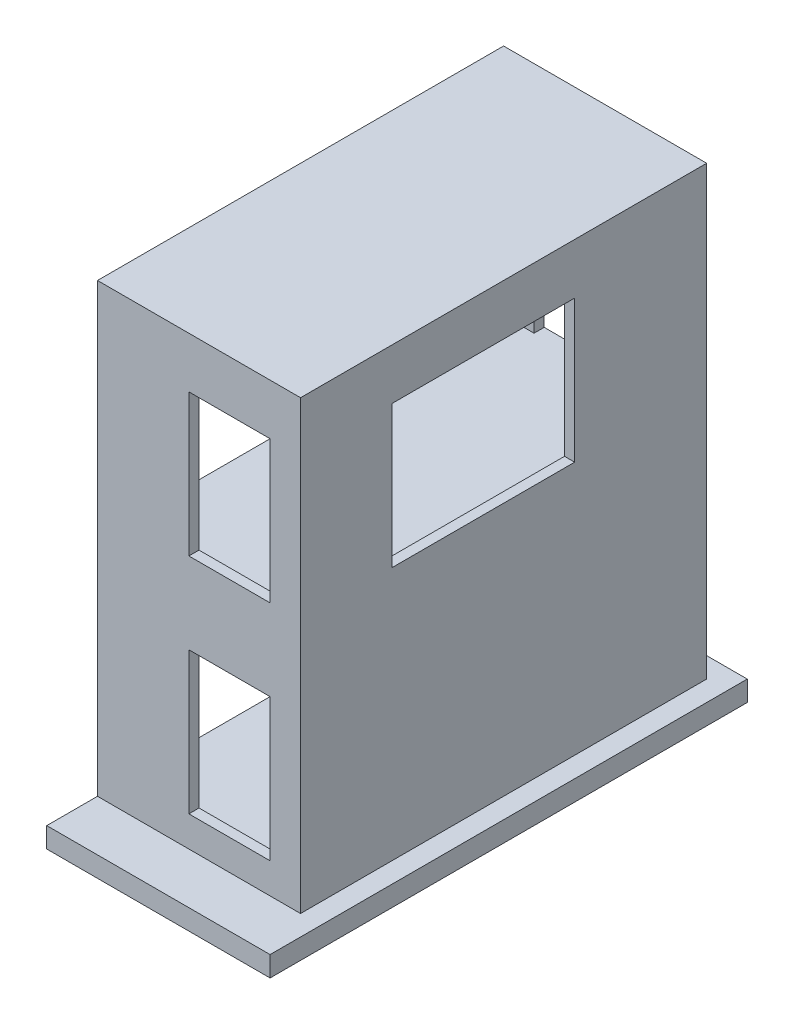
ISO-10303-21;
HEADER;
FILE_DESCRIPTION(('STEP AP214'),'2;1');
FILE_NAME('part.step','',(''),(''),'','','');
FILE_SCHEMA(('AUTOMOTIVE_DESIGN { 1 0 10303 214 1 1 1 1 }'));
ENDSEC;
DATA;
#1=APPLICATION_CONTEXT('core data for automotive mechanical design processes');
#2=APPLICATION_PROTOCOL_DEFINITION('international standard','automotive_design',2000,#1);
#3=PRODUCT_CONTEXT('',#1,'mechanical');
#4=PRODUCT('Part','Part','',(#3));
#5=PRODUCT_RELATED_PRODUCT_CATEGORY('part','',(#4));
#6=PRODUCT_DEFINITION_FORMATION('','',#4);
#7=PRODUCT_DEFINITION_CONTEXT('part definition',#1,'design');
#8=PRODUCT_DEFINITION('design','',#6,#7);
#9=PRODUCT_DEFINITION_SHAPE('','',#8);
#10=(LENGTH_UNIT() NAMED_UNIT(*) SI_UNIT(.MILLI.,.METRE.));
#11=(NAMED_UNIT(*) PLANE_ANGLE_UNIT() SI_UNIT($,.RADIAN.));
#12=(NAMED_UNIT(*) SI_UNIT($,.STERADIAN.) SOLID_ANGLE_UNIT());
#13=UNCERTAINTY_MEASURE_WITH_UNIT(LENGTH_MEASURE(1.E-05),#10,'distance_accuracy_value','');
#14=(GEOMETRIC_REPRESENTATION_CONTEXT(3) GLOBAL_UNCERTAINTY_ASSIGNED_CONTEXT((#13)) GLOBAL_UNIT_ASSIGNED_CONTEXT((#10,
#11,#12)) REPRESENTATION_CONTEXT('',''));
#15=CARTESIAN_POINT('',(0.,0.,0.));
#16=DIRECTION('',(0.,0.,1.));
#17=DIRECTION('',(1.,0.,0.));
#18=AXIS2_PLACEMENT_3D('',#15,#16,#17);
#19=CARTESIAN_POINT('',(0.,220.,0.));
#20=DIRECTION('',(0.,-1.,0.));
#21=DIRECTION('',(0.,0.,-1.));
#22=AXIS2_PLACEMENT_3D('',#19,#20,#21);
#23=PLANE('',#22);
#24=DIRECTION('',(0.,0.,1.));
#25=VECTOR('',#24,1.);
#26=CARTESIAN_POINT('',(45.,220.,-42.4999999999999));
#27=LINE('',#26,#25);
#28=CARTESIAN_POINT('',(44.9999999999999,220.,-102.5));
#29=VERTEX_POINT('',#28);
#30=CARTESIAN_POINT('',(45.,220.,87.5000000000002));
#31=VERTEX_POINT('',#30);
#32=EDGE_CURVE('E431',#29,#31,#27,.T.);
#33=ORIENTED_EDGE('',*,*,#32,.T.);
#34=DIRECTION('',(-1.,0.,0.));
#35=VECTOR('',#34,1.);
#36=CARTESIAN_POINT('',(45.,220.,87.5000000000002));
#37=LINE('',#36,#35);
#38=CARTESIAN_POINT('',(-50.,220.,87.5000000000002));
#39=VERTEX_POINT('',#38);
#40=EDGE_CURVE('E446',#31,#39,#37,.T.);
#41=ORIENTED_EDGE('',*,*,#40,.T.);
#42=DIRECTION('',(0.,0.,1.));
#43=VECTOR('',#42,1.);
#44=CARTESIAN_POINT('',(-50.,220.,92.5000000000002));
#45=LINE('',#44,#43);
#46=CARTESIAN_POINT('',(-50.,220.,-102.5));
#47=VERTEX_POINT('',#46);
#48=EDGE_CURVE('E479',#47,#39,#45,.T.);
#49=ORIENTED_EDGE('',*,*,#48,.F.);
#50=DIRECTION('',(1.,0.,0.));
#51=VECTOR('',#50,1.);
#52=CARTESIAN_POINT('',(44.9999999999999,220.,-102.5));
#53=LINE('',#52,#51);
#54=EDGE_CURVE('E435',#47,#29,#53,.T.);
#55=ORIENTED_EDGE('',*,*,#54,.T.);
#56=EDGE_LOOP('',(#33,#41,#49,#55));
#57=FACE_BOUND('',#56,.T.);
#58=ADVANCED_FACE('F45',(#57),#23,.T.);
#59=CARTESIAN_POINT('',(0.,110.,0.));
#60=DIRECTION('',(0.,-1.,0.));
#61=DIRECTION('',(0.,0.,-1.));
#62=AXIS2_PLACEMENT_3D('',#59,#60,#61);
#63=PLANE('',#62);
#64=DIRECTION('',(-1.,0.,0.));
#65=VECTOR('',#64,1.);
#66=CARTESIAN_POINT('',(34.9999999999999,110.,87.5000000000002));
#67=LINE('',#66,#65);
#68=CARTESIAN_POINT('',(44.9999999999999,110.,87.5000000000002));
#69=VERTEX_POINT('',#68);
#70=CARTESIAN_POINT('',(-50.,110.,87.5000000000002));
#71=VERTEX_POINT('',#70);
#72=EDGE_CURVE('E358',#69,#71,#67,.T.);
#73=ORIENTED_EDGE('',*,*,#72,.T.);
#74=DIRECTION('',(0.,0.,1.));
#75=VECTOR('',#74,1.);
#76=CARTESIAN_POINT('',(-50.,110.,92.5000000000001));
#77=LINE('',#76,#75);
#78=CARTESIAN_POINT('',(-50.,110.,-102.5));
#79=VERTEX_POINT('',#78);
#80=EDGE_CURVE('E410',#79,#71,#77,.T.);
#81=ORIENTED_EDGE('',*,*,#80,.F.);
#82=DIRECTION('',(1.,0.,0.));
#83=VECTOR('',#82,1.);
#84=CARTESIAN_POINT('',(44.9999999999999,110.,-102.5));
#85=LINE('',#84,#83);
#86=CARTESIAN_POINT('',(44.9999999999999,110.,-102.5));
#87=VERTEX_POINT('',#86);
#88=EDGE_CURVE('E363',#79,#87,#85,.T.);
#89=ORIENTED_EDGE('',*,*,#88,.T.);
#90=DIRECTION('',(0.,0.,1.));
#91=VECTOR('',#90,1.);
#92=CARTESIAN_POINT('',(44.9999999999999,110.,87.5000000000002));
#93=LINE('',#92,#91);
#94=EDGE_CURVE('E388',#87,#69,#93,.T.);
#95=ORIENTED_EDGE('',*,*,#94,.T.);
#96=EDGE_LOOP('',(#73,#81,#89,#95));
#97=FACE_BOUND('',#96,.T.);
#98=ADVANCED_FACE('F684',(#97),#63,.T.);
#99=CARTESIAN_POINT('',(0.,10.,0.));
#100=DIRECTION('',(0.,-1.,0.));
#101=DIRECTION('',(0.,0.,-1.));
#102=AXIS2_PLACEMENT_3D('',#99,#100,#101);
#103=PLANE('',#102);
#104=DIRECTION('',(-1.,0.,0.));
#105=VECTOR('',#104,1.);
#106=CARTESIAN_POINT('',(-60.,10.,-117.5));
#107=LINE('',#106,#105);
#108=CARTESIAN_POINT('',(60.,10.,-117.5));
#109=VERTEX_POINT('',#108);
#110=CARTESIAN_POINT('',(-50.,10.,-117.5));
#111=VERTEX_POINT('',#110);
#112=EDGE_CURVE('E312',#109,#111,#107,.T.);
#113=ORIENTED_EDGE('',*,*,#112,.T.);
#114=DIRECTION('',(0.,0.,-1.));
#115=VECTOR('',#114,1.);
#116=CARTESIAN_POINT('',(-50.,10.,-117.5));
#117=LINE('',#116,#115);
#118=CARTESIAN_POINT('',(-50.,10.,-107.5));
#119=VERTEX_POINT('',#118);
#120=EDGE_CURVE('E666',#119,#111,#117,.T.);
#121=ORIENTED_EDGE('',*,*,#120,.F.);
#122=DIRECTION('',(-1.,0.,0.));
#123=VECTOR('',#122,1.);
#124=CARTESIAN_POINT('',(-50.,10.,-107.5));
#125=LINE('',#124,#123);
#126=CARTESIAN_POINT('',(-30.,10.,-107.5));
#127=VERTEX_POINT('',#126);
#128=EDGE_CURVE('E385',#127,#119,#125,.T.);
#129=ORIENTED_EDGE('',*,*,#128,.F.);
#130=DIRECTION('',(0.,0.,-1.));
#131=VECTOR('',#130,1.);
#132=CARTESIAN_POINT('',(-30.,10.,-102.5));
#133=LINE('',#132,#131);
#134=CARTESIAN_POINT('',(-30.,10.,-102.5));
#135=VERTEX_POINT('',#134);
#136=EDGE_CURVE('E587',#135,#127,#133,.T.);
#137=ORIENTED_EDGE('',*,*,#136,.F.);
#138=DIRECTION('',(1.,0.,0.));
#139=VECTOR('',#138,1.);
#140=CARTESIAN_POINT('',(44.9999999999999,10.,-102.5));
#141=LINE('',#140,#139);
#142=CARTESIAN_POINT('',(-50.,10.,-102.5));
#143=VERTEX_POINT('',#142);
#144=EDGE_CURVE('E376',#143,#135,#141,.T.);
#145=ORIENTED_EDGE('',*,*,#144,.F.);
#146=CARTESIAN_POINT('',(-50.,10.,87.5000000000001));
#147=VERTEX_POINT('',#146);
#148=EDGE_CURVE('E665',#147,#143,#117,.T.);
#149=ORIENTED_EDGE('',*,*,#148,.F.);
#150=DIRECTION('',(-1.,0.,0.));
#151=VECTOR('',#150,1.);
#152=CARTESIAN_POINT('',(34.9999999999999,10.,87.5000000000002));
#153=LINE('',#152,#151);
#154=CARTESIAN_POINT('',(44.9999999999999,10.,87.5000000000002));
#155=VERTEX_POINT('',#154);
#156=EDGE_CURVE('E368',#155,#147,#153,.T.);
#157=ORIENTED_EDGE('',*,*,#156,.F.);
#158=DIRECTION('',(0.,0.,1.));
#159=VECTOR('',#158,1.);
#160=CARTESIAN_POINT('',(44.9999999999999,10.,87.5000000000002));
#161=LINE('',#160,#159);
#162=CARTESIAN_POINT('',(44.9999999999999,10.,-102.5));
#163=VERTEX_POINT('',#162);
#164=EDGE_CURVE('E372',#163,#155,#161,.T.);
#165=ORIENTED_EDGE('',*,*,#164,.F.);
#166=CARTESIAN_POINT('',(30.,9.99999999999999,-102.5));
#167=VERTEX_POINT('',#166);
#168=EDGE_CURVE('E380',#167,#163,#141,.T.);
#169=ORIENTED_EDGE('',*,*,#168,.F.);
#170=DIRECTION('',(0.,0.,-1.));
#171=VECTOR('',#170,1.);
#172=CARTESIAN_POINT('',(30.,9.99999999999999,-102.5));
#173=LINE('',#172,#171);
#174=CARTESIAN_POINT('',(30.,9.99999999999999,-107.5));
#175=VERTEX_POINT('',#174);
#176=EDGE_CURVE('E636',#167,#175,#173,.T.);
#177=ORIENTED_EDGE('',*,*,#176,.T.);
#178=CARTESIAN_POINT('',(49.9999999999998,10.,-107.5));
#179=VERTEX_POINT('',#178);
#180=EDGE_CURVE('E381',#179,#175,#125,.T.);
#181=ORIENTED_EDGE('',*,*,#180,.F.);
#182=DIRECTION('',(0.,0.,-1.));
#183=VECTOR('',#182,1.);
#184=CARTESIAN_POINT('',(49.9999999999998,10.,-107.5));
#185=LINE('',#184,#183);
#186=CARTESIAN_POINT('',(49.9999999999998,10.,92.5000000000001));
#187=VERTEX_POINT('',#186);
#188=EDGE_CURVE('E359',#187,#179,#185,.T.);
#189=ORIENTED_EDGE('',*,*,#188,.F.);
#190=DIRECTION('',(1.,0.,0.));
#191=VECTOR('',#190,1.);
#192=CARTESIAN_POINT('',(49.9999999999998,10.,92.5000000000001));
#193=LINE('',#192,#191);
#194=CARTESIAN_POINT('',(-50.0000000000003,10.,92.5000000000005));
#195=VERTEX_POINT('',#194);
#196=EDGE_CURVE('E364',#195,#187,#193,.T.);
#197=ORIENTED_EDGE('',*,*,#196,.F.);
#198=CARTESIAN_POINT('',(-50.,10.,117.5));
#199=VERTEX_POINT('',#198);
#200=EDGE_CURVE('E290',#199,#195,#117,.T.);
#201=ORIENTED_EDGE('',*,*,#200,.F.);
#202=DIRECTION('',(1.,0.,0.));
#203=VECTOR('',#202,1.);
#204=CARTESIAN_POINT('',(-60.,10.,117.5));
#205=LINE('',#204,#203);
#206=CARTESIAN_POINT('',(60.,10.,117.5));
#207=VERTEX_POINT('',#206);
#208=EDGE_CURVE('E298',#199,#207,#205,.T.);
#209=ORIENTED_EDGE('',*,*,#208,.T.);
#210=DIRECTION('',(0.,0.,-1.));
#211=VECTOR('',#210,1.);
#212=CARTESIAN_POINT('',(60.,10.,117.5));
#213=LINE('',#212,#211);
#214=EDGE_CURVE('E306',#207,#109,#213,.T.);
#215=ORIENTED_EDGE('',*,*,#214,.T.);
#216=EDGE_LOOP('',(#113,#121,#129,#137,#145,#149,#157,#165,#169,#177,#181,#189,#197,#201,#209,#215));
#217=FACE_BOUND('',#216,.T.);
#218=ADVANCED_FACE('F674',(#217),#103,.F.);
#219=CARTESIAN_POINT('',(0.,120.,0.));
#220=DIRECTION('',(0.,-1.,0.));
#221=DIRECTION('',(0.,0.,-1.));
#222=AXIS2_PLACEMENT_3D('',#219,#220,#221);
#223=PLANE('',#222);
#224=DIRECTION('',(-1.,0.,0.));
#225=VECTOR('',#224,1.);
#226=CARTESIAN_POINT('',(45.,120.,87.5000000000002));
#227=LINE('',#226,#225);
#228=CARTESIAN_POINT('',(45.,120.,87.5000000000002));
#229=VERTEX_POINT('',#228);
#230=CARTESIAN_POINT('',(-50.,120.,87.5000000000002));
#231=VERTEX_POINT('',#230);
#232=EDGE_CURVE('E449',#229,#231,#227,.T.);
#233=ORIENTED_EDGE('',*,*,#232,.F.);
#234=DIRECTION('',(0.,0.,1.));
#235=VECTOR('',#234,1.);
#236=CARTESIAN_POINT('',(45.,120.,-42.4999999999999));
#237=LINE('',#236,#235);
#238=CARTESIAN_POINT('',(44.9999999999999,120.,-102.5));
#239=VERTEX_POINT('',#238);
#240=EDGE_CURVE('E432',#239,#229,#237,.T.);
#241=ORIENTED_EDGE('',*,*,#240,.F.);
#242=DIRECTION('',(1.,0.,0.));
#243=VECTOR('',#242,1.);
#244=CARTESIAN_POINT('',(44.9999999999999,120.,-102.5));
#245=LINE('',#244,#243);
#246=CARTESIAN_POINT('',(30.,120.,-102.5));
#247=VERTEX_POINT('',#246);
#248=EDGE_CURVE('E440',#247,#239,#245,.T.);
#249=ORIENTED_EDGE('',*,*,#248,.F.);
#250=DIRECTION('',(0.,0.,-1.));
#251=VECTOR('',#250,1.);
#252=CARTESIAN_POINT('',(30.,120.,-102.5));
#253=LINE('',#252,#251);
#254=CARTESIAN_POINT('',(30.,120.,-107.5));
#255=VERTEX_POINT('',#254);
#256=EDGE_CURVE('E621',#247,#255,#253,.T.);
#257=ORIENTED_EDGE('',*,*,#256,.T.);
#258=DIRECTION('',(-1.,0.,0.));
#259=VECTOR('',#258,1.);
#260=CARTESIAN_POINT('',(30.,120.,-107.5));
#261=LINE('',#260,#259);
#262=CARTESIAN_POINT('',(-30.,120.,-107.5));
#263=VERTEX_POINT('',#262);
#264=EDGE_CURVE('E595',#255,#263,#261,.T.);
#265=ORIENTED_EDGE('',*,*,#264,.T.);
#266=DIRECTION('',(0.,0.,-1.));
#267=VECTOR('',#266,1.);
#268=CARTESIAN_POINT('',(-30.,120.,-102.5));
#269=LINE('',#268,#267);
#270=CARTESIAN_POINT('',(-30.,120.,-102.5));
#271=VERTEX_POINT('',#270);
#272=EDGE_CURVE('E618',#271,#263,#269,.T.);
#273=ORIENTED_EDGE('',*,*,#272,.F.);
#274=CARTESIAN_POINT('',(-50.,120.,-102.5));
#275=VERTEX_POINT('',#274);
#276=EDGE_CURVE('E436',#275,#271,#245,.T.);
#277=ORIENTED_EDGE('',*,*,#276,.F.);
#278=DIRECTION('',(0.,0.,1.));
#279=VECTOR('',#278,1.);
#280=CARTESIAN_POINT('',(-50.,120.,92.5000000000001));
#281=LINE('',#280,#279);
#282=EDGE_CURVE('E409',#275,#231,#281,.T.);
#283=ORIENTED_EDGE('',*,*,#282,.T.);
#284=EDGE_LOOP('',(#233,#241,#249,#257,#265,#273,#277,#283));
#285=FACE_BOUND('',#284,.T.);
#286=ADVANCED_FACE('F676',(#285),#223,.F.);
#287=CARTESIAN_POINT('',(60.,10.,117.5));
#288=DIRECTION('',(-1.,0.,0.));
#289=DIRECTION('',(0.,0.,1.));
#290=AXIS2_PLACEMENT_3D('',#287,#288,#289);
#291=PLANE('',#290);
#292=DIRECTION('',(0.,0.,-1.));
#293=VECTOR('',#292,1.);
#294=CARTESIAN_POINT('',(60.,0.,117.5));
#295=LINE('',#294,#293);
#296=CARTESIAN_POINT('',(60.,0.,117.5));
#297=VERTEX_POINT('',#296);
#298=CARTESIAN_POINT('',(60.,0.,-117.5));
#299=VERTEX_POINT('',#298);
#300=EDGE_CURVE('E304',#297,#299,#295,.T.);
#301=ORIENTED_EDGE('',*,*,#300,.T.);
#302=DIRECTION('',(0.,-1.,0.));
#303=VECTOR('',#302,1.);
#304=CARTESIAN_POINT('',(60.,10.,-117.5));
#305=LINE('',#304,#303);
#306=EDGE_CURVE('E11',#109,#299,#305,.T.);
#307=ORIENTED_EDGE('',*,*,#306,.F.);
#308=ORIENTED_EDGE('',*,*,#214,.F.);
#309=DIRECTION('',(0.,-1.,0.));
#310=VECTOR('',#309,1.);
#311=CARTESIAN_POINT('',(60.,10.,117.5));
#312=LINE('',#311,#310);
#313=EDGE_CURVE('E54',#207,#297,#312,.T.);
#314=ORIENTED_EDGE('',*,*,#313,.T.);
#315=EDGE_LOOP('',(#301,#307,#308,#314));
#316=FACE_BOUND('',#315,.T.);
#317=ADVANCED_FACE('F47',(#316),#291,.F.);
#318=CARTESIAN_POINT('',(-60.,10.,-117.5));
#319=DIRECTION('',(0.,0.,1.));
#320=DIRECTION('',(1.,0.,0.));
#321=AXIS2_PLACEMENT_3D('',#318,#319,#320);
#322=PLANE('',#321);
#323=DIRECTION('',(-1.,0.,0.));
#324=VECTOR('',#323,1.);
#325=CARTESIAN_POINT('',(-60.,0.,-117.5));
#326=LINE('',#325,#324);
#327=CARTESIAN_POINT('',(-50.,0.,-117.5));
#328=VERTEX_POINT('',#327);
#329=EDGE_CURVE('E307',#299,#328,#326,.T.);
#330=ORIENTED_EDGE('',*,*,#329,.T.);
#331=DIRECTION('',(0.,1.,0.));
#332=VECTOR('',#331,1.);
#333=CARTESIAN_POINT('',(-50.,0.,-117.5));
#334=LINE('',#333,#332);
#335=EDGE_CURVE('E285',#328,#111,#334,.T.);
#336=ORIENTED_EDGE('',*,*,#335,.T.);
#337=ORIENTED_EDGE('',*,*,#112,.F.);
#338=ORIENTED_EDGE('',*,*,#306,.T.);
#339=EDGE_LOOP('',(#330,#336,#337,#338));
#340=FACE_BOUND('',#339,.T.);
#341=ADVANCED_FACE('F673',(#340),#322,.F.);
#342=CARTESIAN_POINT('',(-60.,10.,117.5));
#343=DIRECTION('',(0.,0.,-1.));
#344=DIRECTION('',(-1.,0.,0.));
#345=AXIS2_PLACEMENT_3D('',#342,#343,#344);
#346=PLANE('',#345);
#347=ORIENTED_EDGE('',*,*,#208,.F.);
#348=DIRECTION('',(0.,1.,0.));
#349=VECTOR('',#348,1.);
#350=CARTESIAN_POINT('',(-50.,0.,117.5));
#351=LINE('',#350,#349);
#352=CARTESIAN_POINT('',(-50.,0.,117.5));
#353=VERTEX_POINT('',#352);
#354=EDGE_CURVE('E282',#353,#199,#351,.T.);
#355=ORIENTED_EDGE('',*,*,#354,.F.);
#356=DIRECTION('',(1.,0.,0.));
#357=VECTOR('',#356,1.);
#358=CARTESIAN_POINT('',(-60.,0.,117.5));
#359=LINE('',#358,#357);
#360=EDGE_CURVE('E296',#353,#297,#359,.T.);
#361=ORIENTED_EDGE('',*,*,#360,.T.);
#362=ORIENTED_EDGE('',*,*,#313,.F.);
#363=EDGE_LOOP('',(#347,#355,#361,#362));
#364=FACE_BOUND('',#363,.T.);
#365=ADVANCED_FACE('F294',(#364),#346,.F.);
#366=CARTESIAN_POINT('',(0.,0.,0.));
#367=DIRECTION('',(0.,-1.,0.));
#368=DIRECTION('',(0.,0.,-1.));
#369=AXIS2_PLACEMENT_3D('',#366,#367,#368);
#370=PLANE('',#369);
#371=DIRECTION('',(0.,0.,-1.));
#372=VECTOR('',#371,1.);
#373=CARTESIAN_POINT('',(-50.,0.,-117.5));
#374=LINE('',#373,#372);
#375=EDGE_CURVE('E278',#353,#328,#374,.T.);
#376=ORIENTED_EDGE('',*,*,#375,.T.);
#377=ORIENTED_EDGE('',*,*,#329,.F.);
#378=ORIENTED_EDGE('',*,*,#300,.F.);
#379=ORIENTED_EDGE('',*,*,#360,.F.);
#380=EDGE_LOOP('',(#376,#377,#378,#379));
#381=FACE_BOUND('',#380,.T.);
#382=ADVANCED_FACE('F302',(#381),#370,.T.);
#383=CARTESIAN_POINT('',(-50.,110.,-107.5));
#384=DIRECTION('',(0.,0.,1.));
#385=DIRECTION('',(1.,0.,0.));
#386=AXIS2_PLACEMENT_3D('',#383,#384,#385);
#387=PLANE('',#386);
#388=DIRECTION('',(1.,0.,0.));
#389=VECTOR('',#388,1.);
#390=CARTESIAN_POINT('',(30.,200.,-107.5));
#391=LINE('',#390,#389);
#392=CARTESIAN_POINT('',(-30.,200.,-107.5));
#393=VERTEX_POINT('',#392);
#394=CARTESIAN_POINT('',(30.,200.,-107.5));
#395=VERTEX_POINT('',#394);
#396=EDGE_CURVE('E607',#393,#395,#391,.T.);
#397=ORIENTED_EDGE('',*,*,#396,.F.);
#398=DIRECTION('',(0.,1.,0.));
#399=VECTOR('',#398,1.);
#400=CARTESIAN_POINT('',(-30.,200.,-107.5));
#401=LINE('',#400,#399);
#402=EDGE_CURVE('E69',#263,#393,#401,.T.);
#403=ORIENTED_EDGE('',*,*,#402,.F.);
#404=ORIENTED_EDGE('',*,*,#264,.F.);
#405=DIRECTION('',(0.,-1.,0.));
#406=VECTOR('',#405,1.);
#407=CARTESIAN_POINT('',(30.,200.,-107.5));
#408=LINE('',#407,#406);
#409=EDGE_CURVE('E611',#395,#255,#408,.T.);
#410=ORIENTED_EDGE('',*,*,#409,.F.);
#411=EDGE_LOOP('',(#397,#403,#404,#410));
#412=FACE_BOUND('',#411,.T.);
#413=DIRECTION('',(1.,0.,0.));
#414=VECTOR('',#413,1.);
#415=CARTESIAN_POINT('',(30.,90.,-107.5));
#416=LINE('',#415,#414);
#417=CARTESIAN_POINT('',(-30.,90.,-107.5));
#418=VERTEX_POINT('',#417);
#419=CARTESIAN_POINT('',(30.,90.,-107.5));
#420=VERTEX_POINT('',#419);
#421=EDGE_CURVE('E646',#418,#420,#416,.T.);
#422=ORIENTED_EDGE('',*,*,#421,.F.);
#423=DIRECTION('',(0.,1.,0.));
#424=VECTOR('',#423,1.);
#425=CARTESIAN_POINT('',(-30.,90.,-107.5));
#426=LINE('',#425,#424);
#427=EDGE_CURVE('E61',#127,#418,#426,.T.);
#428=ORIENTED_EDGE('',*,*,#427,.F.);
#429=ORIENTED_EDGE('',*,*,#128,.T.);
#430=DIRECTION('',(0.,-1.,0.));
#431=VECTOR('',#430,1.);
#432=CARTESIAN_POINT('',(-50.,110.,-107.5));
#433=LINE('',#432,#431);
#434=CARTESIAN_POINT('',(-50.,230.,-107.5));
#435=VERTEX_POINT('',#434);
#436=EDGE_CURVE('E326',#435,#119,#433,.T.);
#437=ORIENTED_EDGE('',*,*,#436,.F.);
#438=DIRECTION('',(-1.,0.,0.));
#439=VECTOR('',#438,1.);
#440=CARTESIAN_POINT('',(-50.,230.,-107.5));
#441=LINE('',#440,#439);
#442=CARTESIAN_POINT('',(49.9999999999998,230.,-107.5));
#443=VERTEX_POINT('',#442);
#444=EDGE_CURVE('E478',#443,#435,#441,.T.);
#445=ORIENTED_EDGE('',*,*,#444,.F.);
#446=DIRECTION('',(0.,-1.,0.));
#447=VECTOR('',#446,1.);
#448=CARTESIAN_POINT('',(49.9999999999998,110.,-107.5));
#449=LINE('',#448,#447);
#450=EDGE_CURVE('E354',#443,#179,#449,.T.);
#451=ORIENTED_EDGE('',*,*,#450,.T.);
#452=ORIENTED_EDGE('',*,*,#180,.T.);
#453=DIRECTION('',(0.,-1.,0.));
#454=VECTOR('',#453,1.);
#455=CARTESIAN_POINT('',(30.,90.,-107.5));
#456=LINE('',#455,#454);
#457=EDGE_CURVE('E641',#420,#175,#456,.T.);
#458=ORIENTED_EDGE('',*,*,#457,.F.);
#459=EDGE_LOOP('',(#422,#428,#429,#437,#445,#451,#452,#458));
#460=FACE_BOUND('',#459,.T.);
#461=ADVANCED_FACE('F754',(#412,#460),#387,.F.);
#462=CARTESIAN_POINT('',(-50.,110.,-102.5));
#463=DIRECTION('',(1.,0.,0.));
#464=DIRECTION('',(0.,0.,-1.));
#465=AXIS2_PLACEMENT_3D('',#462,#463,#464);
#466=PLANE('',#465);
#467=ORIENTED_EDGE('',*,*,#148,.T.);
#468=DIRECTION('',(0.,-1.,0.));
#469=VECTOR('',#468,1.);
#470=CARTESIAN_POINT('',(-50.,110.,-102.5));
#471=LINE('',#470,#469);
#472=EDGE_CURVE('E329',#79,#143,#471,.T.);
#473=ORIENTED_EDGE('',*,*,#472,.F.);
#474=ORIENTED_EDGE('',*,*,#80,.T.);
#475=DIRECTION('',(0.,-1.,0.));
#476=VECTOR('',#475,1.);
#477=CARTESIAN_POINT('',(-50.0000000000003,110.,87.5000000000002));
#478=LINE('',#477,#476);
#479=EDGE_CURVE('E402',#71,#147,#478,.T.);
#480=ORIENTED_EDGE('',*,*,#479,.T.);
#481=EDGE_LOOP('',(#467,#473,#474,#480));
#482=FACE_BOUND('',#481,.T.);
#483=DIRECTION('',(0.,-1.,0.));
#484=VECTOR('',#483,1.);
#485=CARTESIAN_POINT('',(-50.,220.,-102.5));
#486=LINE('',#485,#484);
#487=EDGE_CURVE('E414',#47,#275,#486,.T.);
#488=ORIENTED_EDGE('',*,*,#487,.F.);
#489=ORIENTED_EDGE('',*,*,#48,.T.);
#490=DIRECTION('',(0.,-1.,0.));
#491=VECTOR('',#490,1.);
#492=CARTESIAN_POINT('',(-50.,220.,87.5000000000002));
#493=LINE('',#492,#491);
#494=EDGE_CURVE('E471',#39,#231,#493,.T.);
#495=ORIENTED_EDGE('',*,*,#494,.T.);
#496=ORIENTED_EDGE('',*,*,#282,.F.);
#497=EDGE_LOOP('',(#488,#489,#495,#496));
#498=FACE_BOUND('',#497,.T.);
#499=ORIENTED_EDGE('',*,*,#436,.T.);
#500=ORIENTED_EDGE('',*,*,#120,.T.);
#501=ORIENTED_EDGE('',*,*,#335,.F.);
#502=ORIENTED_EDGE('',*,*,#375,.F.);
#503=ORIENTED_EDGE('',*,*,#354,.T.);
#504=ORIENTED_EDGE('',*,*,#200,.T.);
#505=DIRECTION('',(0.,-1.,0.));
#506=VECTOR('',#505,1.);
#507=CARTESIAN_POINT('',(-50.0000000000003,110.,92.5000000000005));
#508=LINE('',#507,#506);
#509=CARTESIAN_POINT('',(-50.,230.,92.5000000000002));
#510=VERTEX_POINT('',#509);
#511=EDGE_CURVE('E398',#510,#195,#508,.T.);
#512=ORIENTED_EDGE('',*,*,#511,.F.);
#513=DIRECTION('',(0.,0.,1.));
#514=VECTOR('',#513,1.);
#515=CARTESIAN_POINT('',(-50.,230.,92.5000000000002));
#516=LINE('',#515,#514);
#517=EDGE_CURVE('E483',#435,#510,#516,.T.);
#518=ORIENTED_EDGE('',*,*,#517,.F.);
#519=EDGE_LOOP('',(#499,#500,#501,#502,#503,#504,#512,#518));
#520=FACE_BOUND('',#519,.T.);
#521=ADVANCED_FACE('F281',(#482,#498,#520),#466,.F.);
#522=CARTESIAN_POINT('',(44.9999999999999,110.,-102.5));
#523=DIRECTION('',(0.,0.,-1.));
#524=DIRECTION('',(-1.,0.,0.));
#525=AXIS2_PLACEMENT_3D('',#522,#523,#524);
#526=PLANE('',#525);
#527=ORIENTED_EDGE('',*,*,#144,.T.);
#528=DIRECTION('',(0.,1.,0.));
#529=VECTOR('',#528,1.);
#530=CARTESIAN_POINT('',(-30.,90.,-102.5));
#531=LINE('',#530,#529);
#532=CARTESIAN_POINT('',(-30.,90.,-102.5));
#533=VERTEX_POINT('',#532);
#534=EDGE_CURVE('E645',#135,#533,#531,.T.);
#535=ORIENTED_EDGE('',*,*,#534,.T.);
#536=DIRECTION('',(1.,0.,0.));
#537=VECTOR('',#536,1.);
#538=CARTESIAN_POINT('',(30.,90.,-102.5));
#539=LINE('',#538,#537);
#540=CARTESIAN_POINT('',(30.,90.,-102.5));
#541=VERTEX_POINT('',#540);
#542=EDGE_CURVE('E655',#533,#541,#539,.T.);
#543=ORIENTED_EDGE('',*,*,#542,.T.);
#544=DIRECTION('',(0.,-1.,0.));
#545=VECTOR('',#544,1.);
#546=CARTESIAN_POINT('',(30.,90.,-102.5));
#547=LINE('',#546,#545);
#548=EDGE_CURVE('E633',#541,#167,#547,.T.);
#549=ORIENTED_EDGE('',*,*,#548,.T.);
#550=ORIENTED_EDGE('',*,*,#168,.T.);
#551=DIRECTION('',(0.,-1.,0.));
#552=VECTOR('',#551,1.);
#553=CARTESIAN_POINT('',(44.9999999999999,110.,-102.5));
#554=LINE('',#553,#552);
#555=EDGE_CURVE('E334',#87,#163,#554,.T.);
#556=ORIENTED_EDGE('',*,*,#555,.F.);
#557=ORIENTED_EDGE('',*,*,#88,.F.);
#558=ORIENTED_EDGE('',*,*,#472,.T.);
#559=EDGE_LOOP('',(#527,#535,#543,#549,#550,#556,#557,#558));
#560=FACE_BOUND('',#559,.T.);
#561=ADVANCED_FACE('F747',(#560),#526,.F.);
#562=CARTESIAN_POINT('',(44.9999999999999,110.,87.5000000000002));
#563=DIRECTION('',(1.,0.,0.));
#564=DIRECTION('',(0.,0.,-1.));
#565=AXIS2_PLACEMENT_3D('',#562,#563,#564);
#566=PLANE('',#565);
#567=ORIENTED_EDGE('',*,*,#164,.T.);
#568=DIRECTION('',(0.,-1.,0.));
#569=VECTOR('',#568,1.);
#570=CARTESIAN_POINT('',(44.9999999999999,110.,87.5000000000002));
#571=LINE('',#570,#569);
#572=EDGE_CURVE('E340',#69,#155,#571,.T.);
#573=ORIENTED_EDGE('',*,*,#572,.F.);
#574=ORIENTED_EDGE('',*,*,#94,.F.);
#575=ORIENTED_EDGE('',*,*,#555,.T.);
#576=EDGE_LOOP('',(#567,#573,#574,#575));
#577=FACE_BOUND('',#576,.T.);
#578=ADVANCED_FACE('F743',(#577),#566,.F.);
#579=CARTESIAN_POINT('',(34.9999999999999,110.,87.5000000000002));
#580=DIRECTION('',(0.,0.,1.));
#581=DIRECTION('',(1.,0.,0.));
#582=AXIS2_PLACEMENT_3D('',#579,#580,#581);
#583=PLANE('',#582);
#584=DIRECTION('',(0.,-1.,0.));
#585=VECTOR('',#584,1.);
#586=CARTESIAN_POINT('',(34.9999999999999,110.,87.5000000000002));
#587=LINE('',#586,#585);
#588=CARTESIAN_POINT('',(34.9999999999999,95.,87.5000000000016));
#589=VERTEX_POINT('',#588);
#590=CARTESIAN_POINT('',(34.9999999999999,25.,87.5000000000016));
#591=VERTEX_POINT('',#590);
#592=EDGE_CURVE('E344',#589,#591,#587,.T.);
#593=ORIENTED_EDGE('',*,*,#592,.F.);
#594=DIRECTION('',(1.,0.,0.));
#595=VECTOR('',#594,1.);
#596=CARTESIAN_POINT('',(-5.00000000000012,95.,87.5000000000016));
#597=LINE('',#596,#595);
#598=CARTESIAN_POINT('',(-5.00000000000012,95.,87.5000000000016));
#599=VERTEX_POINT('',#598);
#600=EDGE_CURVE('E515',#599,#589,#597,.T.);
#601=ORIENTED_EDGE('',*,*,#600,.F.);
#602=DIRECTION('',(0.,-1.,0.));
#603=VECTOR('',#602,1.);
#604=CARTESIAN_POINT('',(-5.00000000000012,110.,87.5000000000002));
#605=LINE('',#604,#603);
#606=CARTESIAN_POINT('',(-5.00000000000012,25.,87.5000000000016));
#607=VERTEX_POINT('',#606);
#608=EDGE_CURVE('E406',#599,#607,#605,.T.);
#609=ORIENTED_EDGE('',*,*,#608,.T.);
#610=DIRECTION('',(-1.,0.,0.));
#611=VECTOR('',#610,1.);
#612=CARTESIAN_POINT('',(34.9999999999999,25.,87.5000000000016));
#613=LINE('',#612,#611);
#614=EDGE_CURVE('E503',#591,#607,#613,.T.);
#615=ORIENTED_EDGE('',*,*,#614,.F.);
#616=EDGE_LOOP('',(#593,#601,#609,#615));
#617=FACE_BOUND('',#616,.T.);
#618=ORIENTED_EDGE('',*,*,#156,.T.);
#619=ORIENTED_EDGE('',*,*,#479,.F.);
#620=ORIENTED_EDGE('',*,*,#72,.F.);
#621=ORIENTED_EDGE('',*,*,#572,.T.);
#622=EDGE_LOOP('',(#618,#619,#620,#621));
#623=FACE_BOUND('',#622,.T.);
#624=ADVANCED_FACE('F739',(#617,#623),#583,.F.);
#625=CARTESIAN_POINT('',(34.9999999999999,110.,92.5000000000005));
#626=DIRECTION('',(1.,0.,0.));
#627=DIRECTION('',(0.,0.,-1.));
#628=AXIS2_PLACEMENT_3D('',#625,#626,#627);
#629=PLANE('',#628);
#630=DIRECTION('',(0.,-1.,0.));
#631=VECTOR('',#630,1.);
#632=CARTESIAN_POINT('',(34.9999999999999,110.,92.5000000000005));
#633=LINE('',#632,#631);
#634=CARTESIAN_POINT('',(34.9999999999999,95.,92.5000000000016));
#635=VERTEX_POINT('',#634);
#636=CARTESIAN_POINT('',(34.9999999999999,25.,92.5000000000016));
#637=VERTEX_POINT('',#636);
#638=EDGE_CURVE('E347',#635,#637,#633,.T.);
#639=ORIENTED_EDGE('',*,*,#638,.F.);
#640=DIRECTION('',(0.,0.,1.));
#641=VECTOR('',#640,1.);
#642=CARTESIAN_POINT('',(34.9999999999999,95.,87.5000000000016));
#643=LINE('',#642,#641);
#644=EDGE_CURVE('E522',#589,#635,#643,.T.);
#645=ORIENTED_EDGE('',*,*,#644,.F.);
#646=ORIENTED_EDGE('',*,*,#592,.T.);
#647=DIRECTION('',(0.,0.,1.));
#648=VECTOR('',#647,1.);
#649=CARTESIAN_POINT('',(34.9999999999999,25.,87.5000000000016));
#650=LINE('',#649,#648);
#651=EDGE_CURVE('E499',#591,#637,#650,.T.);
#652=ORIENTED_EDGE('',*,*,#651,.T.);
#653=EDGE_LOOP('',(#639,#645,#646,#652));
#654=FACE_BOUND('',#653,.T.);
#655=ADVANCED_FACE('F735',(#654),#629,.F.);
#656=CARTESIAN_POINT('',(49.9999999999998,110.,92.5000000000001));
#657=DIRECTION('',(0.,0.,-1.));
#658=DIRECTION('',(-1.,0.,0.));
#659=AXIS2_PLACEMENT_3D('',#656,#657,#658);
#660=PLANE('',#659);
#661=DIRECTION('',(1.,0.,0.));
#662=VECTOR('',#661,1.);
#663=CARTESIAN_POINT('',(-4.99999999999989,205.,92.5000000000016));
#664=LINE('',#663,#662);
#665=CARTESIAN_POINT('',(-4.99999999999989,205.,92.5000000000016));
#666=VERTEX_POINT('',#665);
#667=CARTESIAN_POINT('',(35.0000000000001,205.,92.5000000000016));
#668=VERTEX_POINT('',#667);
#669=EDGE_CURVE('E541',#666,#668,#664,.T.);
#670=ORIENTED_EDGE('',*,*,#669,.T.);
#671=DIRECTION('',(0.,-1.,0.));
#672=VECTOR('',#671,1.);
#673=CARTESIAN_POINT('',(35.0000000000001,220.,92.5000000000001));
#674=LINE('',#673,#672);
#675=CARTESIAN_POINT('',(35.0000000000001,135.,92.5000000000016));
#676=VERTEX_POINT('',#675);
#677=EDGE_CURVE('E455',#668,#676,#674,.T.);
#678=ORIENTED_EDGE('',*,*,#677,.T.);
#679=DIRECTION('',(-1.,0.,0.));
#680=VECTOR('',#679,1.);
#681=CARTESIAN_POINT('',(-4.9999999999999,135.,92.5000000000016));
#682=LINE('',#681,#680);
#683=CARTESIAN_POINT('',(-4.9999999999999,135.,92.5000000000016));
#684=VERTEX_POINT('',#683);
#685=EDGE_CURVE('E525',#676,#684,#682,.T.);
#686=ORIENTED_EDGE('',*,*,#685,.T.);
#687=DIRECTION('',(0.,-1.,0.));
#688=VECTOR('',#687,1.);
#689=CARTESIAN_POINT('',(-4.99999999999989,220.,92.5000000000001));
#690=LINE('',#689,#688);
#691=EDGE_CURVE('E468',#666,#684,#690,.T.);
#692=ORIENTED_EDGE('',*,*,#691,.F.);
#693=EDGE_LOOP('',(#670,#678,#686,#692));
#694=FACE_BOUND('',#693,.T.);
#695=DIRECTION('',(1.,0.,0.));
#696=VECTOR('',#695,1.);
#697=CARTESIAN_POINT('',(-5.00000000000012,95.,92.5000000000016));
#698=LINE('',#697,#696);
#699=CARTESIAN_POINT('',(-5.00000000000012,95.,92.5000000000016));
#700=VERTEX_POINT('',#699);
#701=EDGE_CURVE('E511',#700,#635,#698,.T.);
#702=ORIENTED_EDGE('',*,*,#701,.T.);
#703=ORIENTED_EDGE('',*,*,#638,.T.);
#704=DIRECTION('',(-1.,0.,0.));
#705=VECTOR('',#704,1.);
#706=CARTESIAN_POINT('',(34.9999999999999,25.,92.5000000000016));
#707=LINE('',#706,#705);
#708=CARTESIAN_POINT('',(-5.00000000000012,25.,92.5000000000016));
#709=VERTEX_POINT('',#708);
#710=EDGE_CURVE('E507',#637,#709,#707,.T.);
#711=ORIENTED_EDGE('',*,*,#710,.T.);
#712=DIRECTION('',(0.,-1.,0.));
#713=VECTOR('',#712,1.);
#714=CARTESIAN_POINT('',(-5.00000000000012,110.,92.5000000000005));
#715=LINE('',#714,#713);
#716=EDGE_CURVE('E395',#700,#709,#715,.T.);
#717=ORIENTED_EDGE('',*,*,#716,.F.);
#718=EDGE_LOOP('',(#702,#703,#711,#717));
#719=FACE_BOUND('',#718,.T.);
#720=DIRECTION('',(0.,-1.,0.));
#721=VECTOR('',#720,1.);
#722=CARTESIAN_POINT('',(49.9999999999998,110.,92.5000000000001));
#723=LINE('',#722,#721);
#724=CARTESIAN_POINT('',(49.9999999999999,230.,92.5000000000001));
#725=VERTEX_POINT('',#724);
#726=EDGE_CURVE('E350',#725,#187,#723,.T.);
#727=ORIENTED_EDGE('',*,*,#726,.F.);
#728=DIRECTION('',(1.,0.,0.));
#729=VECTOR('',#728,1.);
#730=CARTESIAN_POINT('',(49.9999999999999,230.,92.5000000000001));
#731=LINE('',#730,#729);
#732=EDGE_CURVE('E492',#510,#725,#731,.T.);
#733=ORIENTED_EDGE('',*,*,#732,.F.);
#734=ORIENTED_EDGE('',*,*,#511,.T.);
#735=ORIENTED_EDGE('',*,*,#196,.T.);
#736=EDGE_LOOP('',(#727,#733,#734,#735));
#737=FACE_BOUND('',#736,.T.);
#738=ADVANCED_FACE('F731',(#694,#719,#737),#660,.F.);
#739=CARTESIAN_POINT('',(49.9999999999998,110.,-107.5));
#740=DIRECTION('',(-1.,0.,0.));
#741=DIRECTION('',(0.,0.,1.));
#742=AXIS2_PLACEMENT_3D('',#739,#740,#741);
#743=PLANE('',#742);
#744=DIRECTION('',(0.,0.,-1.));
#745=VECTOR('',#744,1.);
#746=CARTESIAN_POINT('',(49.9999999999998,205.,47.4999999999999));
#747=LINE('',#746,#745);
#748=CARTESIAN_POINT('',(49.9999999999998,205.,47.4999999999999));
#749=VERTEX_POINT('',#748);
#750=CARTESIAN_POINT('',(49.9999999999998,205.,-42.4999999999999));
#751=VERTEX_POINT('',#750);
#752=EDGE_CURVE('E571',#749,#751,#747,.T.);
#753=ORIENTED_EDGE('',*,*,#752,.T.);
#754=DIRECTION('',(0.,-1.,0.));
#755=VECTOR('',#754,1.);
#756=CARTESIAN_POINT('',(49.9999999999998,220.,-42.4999999999999));
#757=LINE('',#756,#755);
#758=CARTESIAN_POINT('',(49.9999999999998,135.,-42.4999999999999));
#759=VERTEX_POINT('',#758);
#760=EDGE_CURVE('E428',#751,#759,#757,.T.);
#761=ORIENTED_EDGE('',*,*,#760,.T.);
#762=DIRECTION('',(0.,0.,1.));
#763=VECTOR('',#762,1.);
#764=CARTESIAN_POINT('',(49.9999999999998,135.,47.4999999999999));
#765=LINE('',#764,#763);
#766=CARTESIAN_POINT('',(49.9999999999998,135.,47.4999999999999));
#767=VERTEX_POINT('',#766);
#768=EDGE_CURVE('E567',#759,#767,#765,.T.);
#769=ORIENTED_EDGE('',*,*,#768,.T.);
#770=DIRECTION('',(0.,-1.,0.));
#771=VECTOR('',#770,1.);
#772=CARTESIAN_POINT('',(49.9999999999998,220.,47.4999999999999));
#773=LINE('',#772,#771);
#774=EDGE_CURVE('E450',#749,#767,#773,.T.);
#775=ORIENTED_EDGE('',*,*,#774,.F.);
#776=EDGE_LOOP('',(#753,#761,#769,#775));
#777=FACE_BOUND('',#776,.T.);
#778=ORIENTED_EDGE('',*,*,#450,.F.);
#779=DIRECTION('',(0.,0.,-1.));
#780=VECTOR('',#779,1.);
#781=CARTESIAN_POINT('',(49.9999999999998,230.,-107.5));
#782=LINE('',#781,#780);
#783=EDGE_CURVE('E488',#725,#443,#782,.T.);
#784=ORIENTED_EDGE('',*,*,#783,.F.);
#785=ORIENTED_EDGE('',*,*,#726,.T.);
#786=ORIENTED_EDGE('',*,*,#188,.T.);
#787=EDGE_LOOP('',(#778,#784,#785,#786));
#788=FACE_BOUND('',#787,.T.);
#789=ADVANCED_FACE('F727',(#777,#788),#743,.F.);
#790=CARTESIAN_POINT('',(-5.00000000000012,110.,92.5000000000005));
#791=DIRECTION('',(-1.,0.,0.));
#792=DIRECTION('',(0.,0.,1.));
#793=AXIS2_PLACEMENT_3D('',#790,#791,#792);
#794=PLANE('',#793);
#795=ORIENTED_EDGE('',*,*,#608,.F.);
#796=DIRECTION('',(0.,0.,1.));
#797=VECTOR('',#796,1.);
#798=CARTESIAN_POINT('',(-5.00000000000012,95.,87.5000000000016));
#799=LINE('',#798,#797);
#800=EDGE_CURVE('E518',#599,#700,#799,.T.);
#801=ORIENTED_EDGE('',*,*,#800,.T.);
#802=ORIENTED_EDGE('',*,*,#716,.T.);
#803=DIRECTION('',(0.,0.,1.));
#804=VECTOR('',#803,1.);
#805=CARTESIAN_POINT('',(-5.00000000000012,25.,87.5000000000016));
#806=LINE('',#805,#804);
#807=EDGE_CURVE('E484',#607,#709,#806,.T.);
#808=ORIENTED_EDGE('',*,*,#807,.F.);
#809=EDGE_LOOP('',(#795,#801,#802,#808));
#810=FACE_BOUND('',#809,.T.);
#811=ADVANCED_FACE('F722',(#810),#794,.F.);
#812=CARTESIAN_POINT('',(44.9999999999999,220.,-102.5));
#813=DIRECTION('',(0.,0.,-1.));
#814=DIRECTION('',(-1.,0.,0.));
#815=AXIS2_PLACEMENT_3D('',#812,#813,#814);
#816=PLANE('',#815);
#817=ORIENTED_EDGE('',*,*,#276,.T.);
#818=DIRECTION('',(0.,1.,0.));
#819=VECTOR('',#818,1.);
#820=CARTESIAN_POINT('',(-30.,200.,-102.5));
#821=LINE('',#820,#819);
#822=CARTESIAN_POINT('',(-30.,200.,-102.5));
#823=VERTEX_POINT('',#822);
#824=EDGE_CURVE('E591',#271,#823,#821,.T.);
#825=ORIENTED_EDGE('',*,*,#824,.T.);
#826=DIRECTION('',(1.,0.,0.));
#827=VECTOR('',#826,1.);
#828=CARTESIAN_POINT('',(30.,200.,-102.5));
#829=LINE('',#828,#827);
#830=CARTESIAN_POINT('',(30.,200.,-102.5));
#831=VERTEX_POINT('',#830);
#832=EDGE_CURVE('E596',#823,#831,#829,.T.);
#833=ORIENTED_EDGE('',*,*,#832,.T.);
#834=DIRECTION('',(0.,-1.,0.));
#835=VECTOR('',#834,1.);
#836=CARTESIAN_POINT('',(30.,200.,-102.5));
#837=LINE('',#836,#835);
#838=EDGE_CURVE('E600',#831,#247,#837,.T.);
#839=ORIENTED_EDGE('',*,*,#838,.T.);
#840=ORIENTED_EDGE('',*,*,#248,.T.);
#841=DIRECTION('',(0.,-1.,0.));
#842=VECTOR('',#841,1.);
#843=CARTESIAN_POINT('',(44.9999999999999,220.,-102.5));
#844=LINE('',#843,#842);
#845=EDGE_CURVE('E421',#29,#239,#844,.T.);
#846=ORIENTED_EDGE('',*,*,#845,.F.);
#847=ORIENTED_EDGE('',*,*,#54,.F.);
#848=ORIENTED_EDGE('',*,*,#487,.T.);
#849=EDGE_LOOP('',(#817,#825,#833,#839,#840,#846,#847,#848));
#850=FACE_BOUND('',#849,.T.);
#851=ADVANCED_FACE('F719',(#850),#816,.F.);
#852=CARTESIAN_POINT('',(45.,220.,-42.4999999999999));
#853=DIRECTION('',(1.,0.,0.));
#854=DIRECTION('',(0.,0.,-1.));
#855=AXIS2_PLACEMENT_3D('',#852,#853,#854);
#856=PLANE('',#855);
#857=DIRECTION('',(0.,-1.,0.));
#858=VECTOR('',#857,1.);
#859=CARTESIAN_POINT('',(45.,220.,-42.4999999999999));
#860=LINE('',#859,#858);
#861=CARTESIAN_POINT('',(45.,205.,-42.4999999999999));
#862=VERTEX_POINT('',#861);
#863=CARTESIAN_POINT('',(44.9999999999998,135.,-42.4999999999999));
#864=VERTEX_POINT('',#863);
#865=EDGE_CURVE('E425',#862,#864,#860,.T.);
#866=ORIENTED_EDGE('',*,*,#865,.F.);
#867=DIRECTION('',(0.,0.,-1.));
#868=VECTOR('',#867,1.);
#869=CARTESIAN_POINT('',(44.9999999999998,205.,47.4999999999999));
#870=LINE('',#869,#868);
#871=CARTESIAN_POINT('',(45.,205.,47.4999999999999));
#872=VERTEX_POINT('',#871);
#873=EDGE_CURVE('E575',#872,#862,#870,.T.);
#874=ORIENTED_EDGE('',*,*,#873,.F.);
#875=DIRECTION('',(0.,-1.,0.));
#876=VECTOR('',#875,1.);
#877=CARTESIAN_POINT('',(45.,220.,47.4999999999999));
#878=LINE('',#877,#876);
#879=CARTESIAN_POINT('',(44.9999999999998,135.,47.4999999999999));
#880=VERTEX_POINT('',#879);
#881=EDGE_CURVE('E465',#872,#880,#878,.T.);
#882=ORIENTED_EDGE('',*,*,#881,.T.);
#883=DIRECTION('',(0.,0.,1.));
#884=VECTOR('',#883,1.);
#885=CARTESIAN_POINT('',(44.9999999999998,135.,47.4999999999999));
#886=LINE('',#885,#884);
#887=EDGE_CURVE('E563',#864,#880,#886,.T.);
#888=ORIENTED_EDGE('',*,*,#887,.F.);
#889=EDGE_LOOP('',(#866,#874,#882,#888));
#890=FACE_BOUND('',#889,.T.);
#891=ORIENTED_EDGE('',*,*,#240,.T.);
#892=DIRECTION('',(0.,-1.,0.));
#893=VECTOR('',#892,1.);
#894=CARTESIAN_POINT('',(45.,220.,87.5000000000002));
#895=LINE('',#894,#893);
#896=EDGE_CURVE('E461',#31,#229,#895,.T.);
#897=ORIENTED_EDGE('',*,*,#896,.F.);
#898=ORIENTED_EDGE('',*,*,#32,.F.);
#899=ORIENTED_EDGE('',*,*,#845,.T.);
#900=EDGE_LOOP('',(#891,#897,#898,#899));
#901=FACE_BOUND('',#900,.T.);
#902=ADVANCED_FACE('F715',(#890,#901),#856,.F.);
#903=CARTESIAN_POINT('',(49.9999999999998,220.,-42.4999999999999));
#904=DIRECTION('',(0.,0.,-1.));
#905=DIRECTION('',(-1.,0.,0.));
#906=AXIS2_PLACEMENT_3D('',#903,#904,#905);
#907=PLANE('',#906);
#908=ORIENTED_EDGE('',*,*,#760,.F.);
#909=DIRECTION('',(1.,0.,0.));
#910=VECTOR('',#909,1.);
#911=CARTESIAN_POINT('',(44.9999999999998,205.,-42.4999999999999));
#912=LINE('',#911,#910);
#913=EDGE_CURVE('E583',#862,#751,#912,.T.);
#914=ORIENTED_EDGE('',*,*,#913,.F.);
#915=ORIENTED_EDGE('',*,*,#865,.T.);
#916=DIRECTION('',(1.,0.,0.));
#917=VECTOR('',#916,1.);
#918=CARTESIAN_POINT('',(44.9999999999998,135.,-42.4999999999999));
#919=LINE('',#918,#917);
#920=EDGE_CURVE('E559',#864,#759,#919,.T.);
#921=ORIENTED_EDGE('',*,*,#920,.T.);
#922=EDGE_LOOP('',(#908,#914,#915,#921));
#923=FACE_BOUND('',#922,.T.);
#924=ADVANCED_FACE('F705',(#923),#907,.F.);
#925=CARTESIAN_POINT('',(49.9999999999998,220.,47.4999999999999));
#926=DIRECTION('',(0.,0.,1.));
#927=DIRECTION('',(1.,0.,0.));
#928=AXIS2_PLACEMENT_3D('',#925,#926,#927);
#929=PLANE('',#928);
#930=ORIENTED_EDGE('',*,*,#881,.F.);
#931=DIRECTION('',(1.,0.,0.));
#932=VECTOR('',#931,1.);
#933=CARTESIAN_POINT('',(44.9999999999998,205.,47.4999999999999));
#934=LINE('',#933,#932);
#935=EDGE_CURVE('E579',#872,#749,#934,.T.);
#936=ORIENTED_EDGE('',*,*,#935,.T.);
#937=ORIENTED_EDGE('',*,*,#774,.T.);
#938=DIRECTION('',(1.,0.,0.));
#939=VECTOR('',#938,1.);
#940=CARTESIAN_POINT('',(44.9999999999998,135.,47.4999999999999));
#941=LINE('',#940,#939);
#942=EDGE_CURVE('E555',#880,#767,#941,.T.);
#943=ORIENTED_EDGE('',*,*,#942,.F.);
#944=EDGE_LOOP('',(#930,#936,#937,#943));
#945=FACE_BOUND('',#944,.T.);
#946=ADVANCED_FACE('F701',(#945),#929,.F.);
#947=CARTESIAN_POINT('',(45.,220.,87.5000000000002));
#948=DIRECTION('',(0.,0.,1.));
#949=DIRECTION('',(1.,0.,0.));
#950=AXIS2_PLACEMENT_3D('',#947,#948,#949);
#951=PLANE('',#950);
#952=DIRECTION('',(0.,-1.,0.));
#953=VECTOR('',#952,1.);
#954=CARTESIAN_POINT('',(35.0000000000001,220.,87.5000000000002));
#955=LINE('',#954,#953);
#956=CARTESIAN_POINT('',(35.0000000000001,205.,87.5000000000016));
#957=VERTEX_POINT('',#956);
#958=CARTESIAN_POINT('',(35.0000000000001,135.,87.5000000000016));
#959=VERTEX_POINT('',#958);
#960=EDGE_CURVE('E458',#957,#959,#955,.T.);
#961=ORIENTED_EDGE('',*,*,#960,.F.);
#962=DIRECTION('',(1.,0.,0.));
#963=VECTOR('',#962,1.);
#964=CARTESIAN_POINT('',(-4.99999999999989,205.,87.5000000000016));
#965=LINE('',#964,#963);
#966=CARTESIAN_POINT('',(-4.99999999999989,205.,87.5000000000016));
#967=VERTEX_POINT('',#966);
#968=EDGE_CURVE('E545',#967,#957,#965,.T.);
#969=ORIENTED_EDGE('',*,*,#968,.F.);
#970=DIRECTION('',(0.,-1.,0.));
#971=VECTOR('',#970,1.);
#972=CARTESIAN_POINT('',(-4.99999999999989,220.,87.5000000000002));
#973=LINE('',#972,#971);
#974=CARTESIAN_POINT('',(-4.9999999999999,135.,87.5000000000016));
#975=VERTEX_POINT('',#974);
#976=EDGE_CURVE('E475',#967,#975,#973,.T.);
#977=ORIENTED_EDGE('',*,*,#976,.T.);
#978=DIRECTION('',(-1.,0.,0.));
#979=VECTOR('',#978,1.);
#980=CARTESIAN_POINT('',(-4.9999999999999,135.,87.5000000000016));
#981=LINE('',#980,#979);
#982=EDGE_CURVE('E529',#959,#975,#981,.T.);
#983=ORIENTED_EDGE('',*,*,#982,.F.);
#984=EDGE_LOOP('',(#961,#969,#977,#983));
#985=FACE_BOUND('',#984,.T.);
#986=ORIENTED_EDGE('',*,*,#232,.T.);
#987=ORIENTED_EDGE('',*,*,#494,.F.);
#988=ORIENTED_EDGE('',*,*,#40,.F.);
#989=ORIENTED_EDGE('',*,*,#896,.T.);
#990=EDGE_LOOP('',(#986,#987,#988,#989));
#991=FACE_BOUND('',#990,.T.);
#992=ADVANCED_FACE('F704',(#985,#991),#951,.F.);
#993=CARTESIAN_POINT('',(35.0000000000001,220.,87.5000000000002));
#994=DIRECTION('',(1.,0.,0.));
#995=DIRECTION('',(0.,0.,-1.));
#996=AXIS2_PLACEMENT_3D('',#993,#994,#995);
#997=PLANE('',#996);
#998=ORIENTED_EDGE('',*,*,#677,.F.);
#999=DIRECTION('',(0.,0.,1.));
#1000=VECTOR('',#999,1.);
#1001=CARTESIAN_POINT('',(35.0000000000001,205.,87.5000000000016));
#1002=LINE('',#1001,#1000);
#1003=EDGE_CURVE('E552',#957,#668,#1002,.T.);
#1004=ORIENTED_EDGE('',*,*,#1003,.F.);
#1005=ORIENTED_EDGE('',*,*,#960,.T.);
#1006=DIRECTION('',(0.,0.,1.));
#1007=VECTOR('',#1006,1.);
#1008=CARTESIAN_POINT('',(35.0000000000001,135.,87.5000000000016));
#1009=LINE('',#1008,#1007);
#1010=EDGE_CURVE('E533',#959,#676,#1009,.T.);
#1011=ORIENTED_EDGE('',*,*,#1010,.T.);
#1012=EDGE_LOOP('',(#998,#1004,#1005,#1011));
#1013=FACE_BOUND('',#1012,.T.);
#1014=ADVANCED_FACE('F699',(#1013),#997,.F.);
#1015=CARTESIAN_POINT('',(-4.99999999999989,220.,87.5000000000002));
#1016=DIRECTION('',(-1.,0.,0.));
#1017=DIRECTION('',(0.,0.,1.));
#1018=AXIS2_PLACEMENT_3D('',#1015,#1016,#1017);
#1019=PLANE('',#1018);
#1020=ORIENTED_EDGE('',*,*,#976,.F.);
#1021=DIRECTION('',(0.,0.,1.));
#1022=VECTOR('',#1021,1.);
#1023=CARTESIAN_POINT('',(-4.99999999999989,205.,87.5000000000016));
#1024=LINE('',#1023,#1022);
#1025=EDGE_CURVE('E548',#967,#666,#1024,.T.);
#1026=ORIENTED_EDGE('',*,*,#1025,.T.);
#1027=ORIENTED_EDGE('',*,*,#691,.T.);
#1028=DIRECTION('',(0.,0.,1.));
#1029=VECTOR('',#1028,1.);
#1030=CARTESIAN_POINT('',(-4.9999999999999,135.,87.5000000000016));
#1031=LINE('',#1030,#1029);
#1032=EDGE_CURVE('E537',#975,#684,#1031,.T.);
#1033=ORIENTED_EDGE('',*,*,#1032,.F.);
#1034=EDGE_LOOP('',(#1020,#1026,#1027,#1033));
#1035=FACE_BOUND('',#1034,.T.);
#1036=ADVANCED_FACE('F696',(#1035),#1019,.F.);
#1037=CARTESIAN_POINT('',(0.,230.,0.));
#1038=DIRECTION('',(0.,-1.,0.));
#1039=DIRECTION('',(0.,0.,-1.));
#1040=AXIS2_PLACEMENT_3D('',#1037,#1038,#1039);
#1041=PLANE('',#1040);
#1042=ORIENTED_EDGE('',*,*,#517,.T.);
#1043=ORIENTED_EDGE('',*,*,#732,.T.);
#1044=ORIENTED_EDGE('',*,*,#783,.T.);
#1045=ORIENTED_EDGE('',*,*,#444,.T.);
#1046=EDGE_LOOP('',(#1042,#1043,#1044,#1045));
#1047=FACE_BOUND('',#1046,.T.);
#1048=ADVANCED_FACE('F694',(#1047),#1041,.F.);
#1049=CARTESIAN_POINT('',(34.9999999999999,25.,87.5000000000016));
#1050=DIRECTION('',(0.,1.,0.));
#1051=DIRECTION('',(-1.,0.,0.));
#1052=AXIS2_PLACEMENT_3D('',#1049,#1050,#1051);
#1053=PLANE('',#1052);
#1054=ORIENTED_EDGE('',*,*,#710,.F.);
#1055=ORIENTED_EDGE('',*,*,#651,.F.);
#1056=ORIENTED_EDGE('',*,*,#614,.T.);
#1057=ORIENTED_EDGE('',*,*,#807,.T.);
#1058=EDGE_LOOP('',(#1054,#1055,#1056,#1057));
#1059=FACE_BOUND('',#1058,.T.);
#1060=ADVANCED_FACE('F847',(#1059),#1053,.T.);
#1061=CARTESIAN_POINT('',(-5.00000000000012,95.,87.5000000000016));
#1062=DIRECTION('',(0.,-1.,0.));
#1063=DIRECTION('',(0.,0.,-1.));
#1064=AXIS2_PLACEMENT_3D('',#1061,#1062,#1063);
#1065=PLANE('',#1064);
#1066=ORIENTED_EDGE('',*,*,#701,.F.);
#1067=ORIENTED_EDGE('',*,*,#800,.F.);
#1068=ORIENTED_EDGE('',*,*,#600,.T.);
#1069=ORIENTED_EDGE('',*,*,#644,.T.);
#1070=EDGE_LOOP('',(#1066,#1067,#1068,#1069));
#1071=FACE_BOUND('',#1070,.T.);
#1072=ADVANCED_FACE('F853',(#1071),#1065,.T.);
#1073=CARTESIAN_POINT('',(-4.9999999999999,135.,87.5000000000016));
#1074=DIRECTION('',(0.,1.,0.));
#1075=DIRECTION('',(0.,0.,1.));
#1076=AXIS2_PLACEMENT_3D('',#1073,#1074,#1075);
#1077=PLANE('',#1076);
#1078=ORIENTED_EDGE('',*,*,#685,.F.);
#1079=ORIENTED_EDGE('',*,*,#1010,.F.);
#1080=ORIENTED_EDGE('',*,*,#982,.T.);
#1081=ORIENTED_EDGE('',*,*,#1032,.T.);
#1082=EDGE_LOOP('',(#1078,#1079,#1080,#1081));
#1083=FACE_BOUND('',#1082,.T.);
#1084=ADVANCED_FACE('F860',(#1083),#1077,.T.);
#1085=CARTESIAN_POINT('',(-4.99999999999989,205.,87.5000000000016));
#1086=DIRECTION('',(0.,-1.,0.));
#1087=DIRECTION('',(0.,0.,-1.));
#1088=AXIS2_PLACEMENT_3D('',#1085,#1086,#1087);
#1089=PLANE('',#1088);
#1090=ORIENTED_EDGE('',*,*,#669,.F.);
#1091=ORIENTED_EDGE('',*,*,#1025,.F.);
#1092=ORIENTED_EDGE('',*,*,#968,.T.);
#1093=ORIENTED_EDGE('',*,*,#1003,.T.);
#1094=EDGE_LOOP('',(#1090,#1091,#1092,#1093));
#1095=FACE_BOUND('',#1094,.T.);
#1096=ADVANCED_FACE('F868',(#1095),#1089,.T.);
#1097=CARTESIAN_POINT('',(44.9999999999998,135.,47.4999999999999));
#1098=DIRECTION('',(0.,1.,0.));
#1099=DIRECTION('',(0.,0.,1.));
#1100=AXIS2_PLACEMENT_3D('',#1097,#1098,#1099);
#1101=PLANE('',#1100);
#1102=ORIENTED_EDGE('',*,*,#768,.F.);
#1103=ORIENTED_EDGE('',*,*,#920,.F.);
#1104=ORIENTED_EDGE('',*,*,#887,.T.);
#1105=ORIENTED_EDGE('',*,*,#942,.T.);
#1106=EDGE_LOOP('',(#1102,#1103,#1104,#1105));
#1107=FACE_BOUND('',#1106,.T.);
#1108=ADVANCED_FACE('F876',(#1107),#1101,.T.);
#1109=CARTESIAN_POINT('',(44.9999999999998,205.,47.4999999999999));
#1110=DIRECTION('',(0.,-1.,0.));
#1111=DIRECTION('',(0.,0.,-1.));
#1112=AXIS2_PLACEMENT_3D('',#1109,#1110,#1111);
#1113=PLANE('',#1112);
#1114=ORIENTED_EDGE('',*,*,#752,.F.);
#1115=ORIENTED_EDGE('',*,*,#935,.F.);
#1116=ORIENTED_EDGE('',*,*,#873,.T.);
#1117=ORIENTED_EDGE('',*,*,#913,.T.);
#1118=EDGE_LOOP('',(#1114,#1115,#1116,#1117));
#1119=FACE_BOUND('',#1118,.T.);
#1120=ADVANCED_FACE('F883',(#1119),#1113,.T.);
#1121=CARTESIAN_POINT('',(-30.,200.,-102.5));
#1122=DIRECTION('',(-1.,0.,0.));
#1123=DIRECTION('',(0.,-1.,0.));
#1124=AXIS2_PLACEMENT_3D('',#1121,#1122,#1123);
#1125=PLANE('',#1124);
#1126=ORIENTED_EDGE('',*,*,#402,.T.);
#1127=DIRECTION('',(0.,0.,-1.));
#1128=VECTOR('',#1127,1.);
#1129=CARTESIAN_POINT('',(-30.,200.,-102.5));
#1130=LINE('',#1129,#1128);
#1131=EDGE_CURVE('E604',#823,#393,#1130,.T.);
#1132=ORIENTED_EDGE('',*,*,#1131,.F.);
#1133=ORIENTED_EDGE('',*,*,#824,.F.);
#1134=ORIENTED_EDGE('',*,*,#272,.T.);
#1135=EDGE_LOOP('',(#1126,#1132,#1133,#1134));
#1136=FACE_BOUND('',#1135,.T.);
#1137=ADVANCED_FACE('F891',(#1136),#1125,.F.);
#1138=CARTESIAN_POINT('',(30.,200.,-102.5));
#1139=DIRECTION('',(1.,0.,0.));
#1140=DIRECTION('',(0.,1.,0.));
#1141=AXIS2_PLACEMENT_3D('',#1138,#1139,#1140);
#1142=PLANE('',#1141);
#1143=ORIENTED_EDGE('',*,*,#409,.T.);
#1144=ORIENTED_EDGE('',*,*,#256,.F.);
#1145=ORIENTED_EDGE('',*,*,#838,.F.);
#1146=DIRECTION('',(0.,0.,-1.));
#1147=VECTOR('',#1146,1.);
#1148=CARTESIAN_POINT('',(30.,200.,-102.5));
#1149=LINE('',#1148,#1147);
#1150=EDGE_CURVE('E624',#831,#395,#1149,.T.);
#1151=ORIENTED_EDGE('',*,*,#1150,.T.);
#1152=EDGE_LOOP('',(#1143,#1144,#1145,#1151));
#1153=FACE_BOUND('',#1152,.T.);
#1154=ADVANCED_FACE('F898',(#1153),#1142,.F.);
#1155=CARTESIAN_POINT('',(30.,200.,-102.5));
#1156=DIRECTION('',(0.,1.,0.));
#1157=DIRECTION('',(0.,0.,1.));
#1158=AXIS2_PLACEMENT_3D('',#1155,#1156,#1157);
#1159=PLANE('',#1158);
#1160=ORIENTED_EDGE('',*,*,#396,.T.);
#1161=ORIENTED_EDGE('',*,*,#1150,.F.);
#1162=ORIENTED_EDGE('',*,*,#832,.F.);
#1163=ORIENTED_EDGE('',*,*,#1131,.T.);
#1164=EDGE_LOOP('',(#1160,#1161,#1162,#1163));
#1165=FACE_BOUND('',#1164,.T.);
#1166=ADVANCED_FACE('F905',(#1165),#1159,.F.);
#1167=CARTESIAN_POINT('',(-30.,90.,-102.5));
#1168=DIRECTION('',(-1.,0.,0.));
#1169=DIRECTION('',(0.,-1.,0.));
#1170=AXIS2_PLACEMENT_3D('',#1167,#1168,#1169);
#1171=PLANE('',#1170);
#1172=ORIENTED_EDGE('',*,*,#427,.T.);
#1173=DIRECTION('',(0.,0.,-1.));
#1174=VECTOR('',#1173,1.);
#1175=CARTESIAN_POINT('',(-30.,90.,-102.5));
#1176=LINE('',#1175,#1174);
#1177=EDGE_CURVE('E629',#533,#418,#1176,.T.);
#1178=ORIENTED_EDGE('',*,*,#1177,.F.);
#1179=ORIENTED_EDGE('',*,*,#534,.F.);
#1180=ORIENTED_EDGE('',*,*,#136,.T.);
#1181=EDGE_LOOP('',(#1172,#1178,#1179,#1180));
#1182=FACE_BOUND('',#1181,.T.);
#1183=ADVANCED_FACE('F913',(#1182),#1171,.F.);
#1184=CARTESIAN_POINT('',(30.,90.,-102.5));
#1185=DIRECTION('',(1.,0.,0.));
#1186=DIRECTION('',(0.,1.,0.));
#1187=AXIS2_PLACEMENT_3D('',#1184,#1185,#1186);
#1188=PLANE('',#1187);
#1189=ORIENTED_EDGE('',*,*,#457,.T.);
#1190=ORIENTED_EDGE('',*,*,#176,.F.);
#1191=ORIENTED_EDGE('',*,*,#548,.F.);
#1192=DIRECTION('',(0.,0.,-1.));
#1193=VECTOR('',#1192,1.);
#1194=CARTESIAN_POINT('',(30.,90.,-102.5));
#1195=LINE('',#1194,#1193);
#1196=EDGE_CURVE('E632',#541,#420,#1195,.T.);
#1197=ORIENTED_EDGE('',*,*,#1196,.T.);
#1198=EDGE_LOOP('',(#1189,#1190,#1191,#1197));
#1199=FACE_BOUND('',#1198,.T.);
#1200=ADVANCED_FACE('F921',(#1199),#1188,.F.);
#1201=CARTESIAN_POINT('',(30.,90.,-102.5));
#1202=DIRECTION('',(0.,1.,0.));
#1203=DIRECTION('',(0.,0.,1.));
#1204=AXIS2_PLACEMENT_3D('',#1201,#1202,#1203);
#1205=PLANE('',#1204);
#1206=ORIENTED_EDGE('',*,*,#421,.T.);
#1207=ORIENTED_EDGE('',*,*,#1196,.F.);
#1208=ORIENTED_EDGE('',*,*,#542,.F.);
#1209=ORIENTED_EDGE('',*,*,#1177,.T.);
#1210=EDGE_LOOP('',(#1206,#1207,#1208,#1209));
#1211=FACE_BOUND('',#1210,.T.);
#1212=ADVANCED_FACE('F928',(#1211),#1205,.F.);
#1213=CLOSED_SHELL('',(#58,#98,#218,#286,#317,#341,#365,#382,#461,#521,#561,#578,#624,#655,#738,
#789,#811,#851,#902,#924,#946,#992,#1014,#1036,#1048,#1060,#1072,#1084,#1096,#1108,#1120,#1137,
#1154,#1166,#1183,#1200,#1212));
#1214=MANIFOLD_SOLID_BREP('B2',#1213);
#1215=ADVANCED_BREP_SHAPE_REPRESENTATION('',(#18,#1214),#14);
#1216=SHAPE_DEFINITION_REPRESENTATION(#9,#1215);
ENDSEC;
END-ISO-10303-21;
